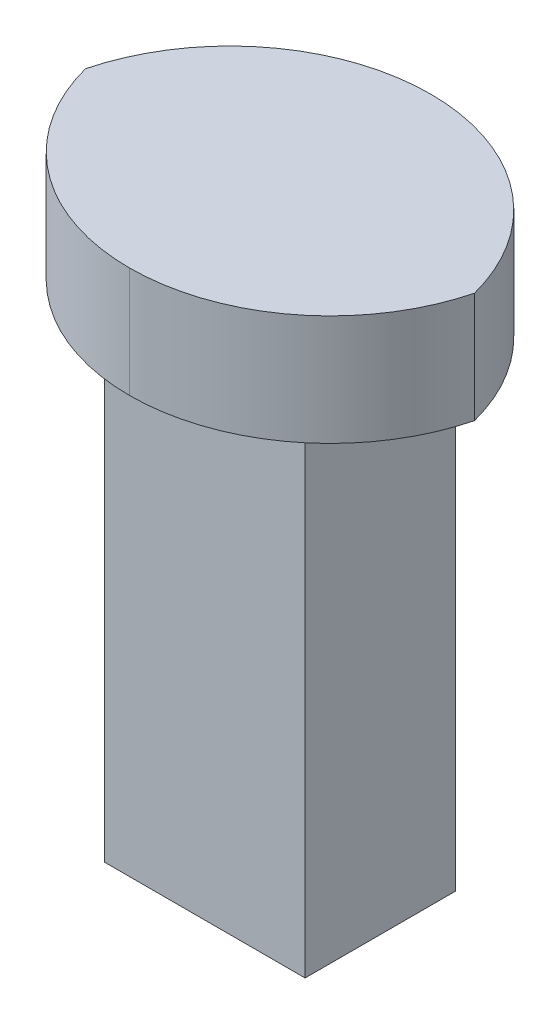
ISO-10303-21;
HEADER;
FILE_DESCRIPTION(('STEP AP214'),'2;1');
FILE_NAME('part.step','',(''),(''),'','','');
FILE_SCHEMA(('AUTOMOTIVE_DESIGN { 1 0 10303 214 1 1 1 1 }'));
ENDSEC;
DATA;
#1=APPLICATION_CONTEXT('core data for automotive mechanical design processes');
#2=APPLICATION_PROTOCOL_DEFINITION('international standard','automotive_design',2000,#1);
#3=PRODUCT_CONTEXT('',#1,'mechanical');
#4=PRODUCT('Part','Part','',(#3));
#5=PRODUCT_RELATED_PRODUCT_CATEGORY('part','',(#4));
#6=PRODUCT_DEFINITION_FORMATION('','',#4);
#7=PRODUCT_DEFINITION_CONTEXT('part definition',#1,'design');
#8=PRODUCT_DEFINITION('design','',#6,#7);
#9=PRODUCT_DEFINITION_SHAPE('','',#8);
#10=(LENGTH_UNIT() NAMED_UNIT(*) SI_UNIT(.MILLI.,.METRE.));
#11=(NAMED_UNIT(*) PLANE_ANGLE_UNIT() SI_UNIT($,.RADIAN.));
#12=(NAMED_UNIT(*) SI_UNIT($,.STERADIAN.) SOLID_ANGLE_UNIT());
#13=UNCERTAINTY_MEASURE_WITH_UNIT(LENGTH_MEASURE(1.E-05),#10,'distance_accuracy_value','');
#14=(GEOMETRIC_REPRESENTATION_CONTEXT(3) GLOBAL_UNCERTAINTY_ASSIGNED_CONTEXT((#13)) GLOBAL_UNIT_ASSIGNED_CONTEXT((#10,
#11,#12)) REPRESENTATION_CONTEXT('',''));
#15=CARTESIAN_POINT('',(0.,0.,0.));
#16=DIRECTION('',(0.,0.,1.));
#17=DIRECTION('',(1.,0.,0.));
#18=AXIS2_PLACEMENT_3D('',#15,#16,#17);
#19=CARTESIAN_POINT('',(0.,-2.794,0.));
#20=DIRECTION('',(0.,1.,0.));
#21=DIRECTION('',(0.,0.,-1.));
#22=AXIS2_PLACEMENT_3D('',#19,#20,#21);
#23=PLANE('',#22);
#24=DIRECTION('',(-1.,0.,0.));
#25=VECTOR('',#24,1.);
#26=CARTESIAN_POINT('',(0.,-2.794,1.905));
#27=LINE('',#26,#25);
#28=CARTESIAN_POINT('',(2.54,-2.794,1.905));
#29=VERTEX_POINT('',#28);
#30=CARTESIAN_POINT('',(-2.54,-2.794,1.905));
#31=VERTEX_POINT('',#30);
#32=EDGE_CURVE('E140',#29,#31,#27,.T.);
#33=ORIENTED_EDGE('',*,*,#32,.F.);
#34=DIRECTION('',(0.,0.,1.));
#35=VECTOR('',#34,1.);
#36=CARTESIAN_POINT('',(2.54,-2.794,0.));
#37=LINE('',#36,#35);
#38=CARTESIAN_POINT('',(2.54,-2.794,-1.905));
#39=VERTEX_POINT('',#38);
#40=EDGE_CURVE('E137',#39,#29,#37,.T.);
#41=ORIENTED_EDGE('',*,*,#40,.F.);
#42=DIRECTION('',(0.8,0.,-0.6));
#43=VECTOR('',#42,1.);
#44=CARTESIAN_POINT('',(0.,-2.794,0.));
#45=LINE('',#44,#43);
#46=EDGE_CURVE('E126',#31,#39,#45,.T.);
#47=ORIENTED_EDGE('',*,*,#46,.F.);
#48=EDGE_LOOP('',(#33,#41,#47));
#49=FACE_BOUND('',#48,.T.);
#50=CARTESIAN_POINT('',(0.,-2.794,1.27));
#51=DIRECTION('',(0.,-1.,0.));
#52=DIRECTION('',(0.,0.,-1.));
#53=AXIS2_PLACEMENT_3D('',#50,#51,#52);
#54=CIRCLE('',#53,5.08);
#55=CARTESIAN_POINT('',(4.91868884968342,-2.794,0.));
#56=VERTEX_POINT('',#55);
#57=CARTESIAN_POINT('',(0.,-2.794,-3.81));
#58=VERTEX_POINT('',#57);
#59=EDGE_CURVE('E160',#56,#58,#54,.F.);
#60=ORIENTED_EDGE('',*,*,#59,.F.);
#61=CARTESIAN_POINT('',(0.,-2.794,-1.27));
#62=DIRECTION('',(0.,-1.,0.));
#63=DIRECTION('',(0.,0.,-1.));
#64=AXIS2_PLACEMENT_3D('',#61,#62,#63);
#65=CIRCLE('',#64,5.08);
#66=CARTESIAN_POINT('',(0.,-2.794,3.81));
#67=VERTEX_POINT('',#66);
#68=EDGE_CURVE('E163',#67,#56,#65,.F.);
#69=ORIENTED_EDGE('',*,*,#68,.F.);
#70=CARTESIAN_POINT('',(0.,-2.794,-1.27));
#71=DIRECTION('',(0.,-1.,0.));
#72=DIRECTION('',(0.,0.,-1.));
#73=AXIS2_PLACEMENT_3D('',#70,#71,#72);
#74=CIRCLE('',#73,5.08);
#75=CARTESIAN_POINT('',(-4.91868884968342,-2.794,0.));
#76=VERTEX_POINT('',#75);
#77=EDGE_CURVE('E53',#76,#67,#74,.F.);
#78=ORIENTED_EDGE('',*,*,#77,.F.);
#79=CARTESIAN_POINT('',(0.,-2.794,1.27));
#80=DIRECTION('',(0.,-1.,0.));
#81=DIRECTION('',(0.,0.,-1.));
#82=AXIS2_PLACEMENT_3D('',#79,#80,#81);
#83=CIRCLE('',#82,5.08);
#84=EDGE_CURVE('E11',#58,#76,#83,.F.);
#85=ORIENTED_EDGE('',*,*,#84,.F.);
#86=EDGE_LOOP('',(#60,#69,#78,#85));
#87=FACE_BOUND('',#86,.T.);
#88=ADVANCED_FACE('F43',(#49,#87),#23,.F.);
#89=CARTESIAN_POINT('',(0.,0.,0.));
#90=DIRECTION('',(0.,1.,0.));
#91=DIRECTION('',(0.,0.,-1.));
#92=AXIS2_PLACEMENT_3D('',#89,#90,#91);
#93=PLANE('',#92);
#94=CARTESIAN_POINT('',(0.,0.,-1.27));
#95=DIRECTION('',(0.,-1.,0.));
#96=DIRECTION('',(0.,0.,-1.));
#97=AXIS2_PLACEMENT_3D('',#94,#95,#96);
#98=CIRCLE('',#97,5.08);
#99=CARTESIAN_POINT('',(0.,0.,3.81));
#100=VERTEX_POINT('',#99);
#101=CARTESIAN_POINT('',(-4.91868884968342,0.,0.));
#102=VERTEX_POINT('',#101);
#103=EDGE_CURVE('E153',#100,#102,#98,.T.);
#104=ORIENTED_EDGE('',*,*,#103,.F.);
#105=CARTESIAN_POINT('',(0.,0.,-1.27));
#106=DIRECTION('',(0.,-1.,0.));
#107=DIRECTION('',(0.,0.,-1.));
#108=AXIS2_PLACEMENT_3D('',#105,#106,#107);
#109=CIRCLE('',#108,5.08);
#110=CARTESIAN_POINT('',(4.91868884968342,0.,0.));
#111=VERTEX_POINT('',#110);
#112=EDGE_CURVE('E149',#111,#100,#109,.T.);
#113=ORIENTED_EDGE('',*,*,#112,.F.);
#114=CARTESIAN_POINT('',(0.,0.,1.27));
#115=DIRECTION('',(0.,-1.,0.));
#116=DIRECTION('',(0.,0.,-1.));
#117=AXIS2_PLACEMENT_3D('',#114,#115,#116);
#118=CIRCLE('',#117,5.08);
#119=CARTESIAN_POINT('',(0.,0.,-3.81));
#120=VERTEX_POINT('',#119);
#121=EDGE_CURVE('E146',#120,#111,#118,.T.);
#122=ORIENTED_EDGE('',*,*,#121,.F.);
#123=CARTESIAN_POINT('',(0.,0.,1.27));
#124=DIRECTION('',(0.,-1.,0.));
#125=DIRECTION('',(0.,0.,-1.));
#126=AXIS2_PLACEMENT_3D('',#123,#124,#125);
#127=CIRCLE('',#126,5.08);
#128=EDGE_CURVE('E156',#102,#120,#127,.T.);
#129=ORIENTED_EDGE('',*,*,#128,.F.);
#130=EDGE_LOOP('',(#104,#113,#122,#129));
#131=FACE_BOUND('',#130,.T.);
#132=ADVANCED_FACE('F184',(#131),#93,.T.);
#133=CARTESIAN_POINT('',(2.54,-15.24,-1.905));
#134=DIRECTION('',(-0.6,0.,-0.8));
#135=DIRECTION('',(0.8,0.,-0.6));
#136=AXIS2_PLACEMENT_3D('',#133,#134,#135);
#137=PLANE('',#136);
#138=ORIENTED_EDGE('',*,*,#46,.T.);
#139=DIRECTION('',(0.,1.,0.));
#140=VECTOR('',#139,1.);
#141=CARTESIAN_POINT('',(2.54,-15.24,-1.905));
#142=LINE('',#141,#140);
#143=CARTESIAN_POINT('',(2.54,-15.24,-1.905));
#144=VERTEX_POINT('',#143);
#145=EDGE_CURVE('E109',#144,#39,#142,.T.);
#146=ORIENTED_EDGE('',*,*,#145,.F.);
#147=DIRECTION('',(0.8,0.,-0.6));
#148=VECTOR('',#147,1.);
#149=CARTESIAN_POINT('',(2.54,-15.24,-1.905));
#150=LINE('',#149,#148);
#151=CARTESIAN_POINT('',(-2.54,-15.24,1.905));
#152=VERTEX_POINT('',#151);
#153=EDGE_CURVE('E116',#152,#144,#150,.T.);
#154=ORIENTED_EDGE('',*,*,#153,.F.);
#155=DIRECTION('',(0.,1.,0.));
#156=VECTOR('',#155,1.);
#157=CARTESIAN_POINT('',(-2.54,-15.24,1.905));
#158=LINE('',#157,#156);
#159=EDGE_CURVE('E132',#152,#31,#158,.T.);
#160=ORIENTED_EDGE('',*,*,#159,.T.);
#161=EDGE_LOOP('',(#138,#146,#154,#160));
#162=FACE_BOUND('',#161,.T.);
#163=ADVANCED_FACE('F124',(#162),#137,.T.);
#164=CARTESIAN_POINT('',(-2.54,-15.24,1.905));
#165=DIRECTION('',(0.,0.,1.));
#166=DIRECTION('',(-1.,0.,0.));
#167=AXIS2_PLACEMENT_3D('',#164,#165,#166);
#168=PLANE('',#167);
#169=ORIENTED_EDGE('',*,*,#32,.T.);
#170=ORIENTED_EDGE('',*,*,#159,.F.);
#171=DIRECTION('',(-1.,0.,0.));
#172=VECTOR('',#171,1.);
#173=CARTESIAN_POINT('',(-2.54,-15.24,1.905));
#174=LINE('',#173,#172);
#175=CARTESIAN_POINT('',(2.54,-15.24,1.905));
#176=VERTEX_POINT('',#175);
#177=EDGE_CURVE('E115',#176,#152,#174,.T.);
#178=ORIENTED_EDGE('',*,*,#177,.F.);
#179=DIRECTION('',(0.,1.,0.));
#180=VECTOR('',#179,1.);
#181=CARTESIAN_POINT('',(2.54,-15.24,1.905));
#182=LINE('',#181,#180);
#183=EDGE_CURVE('E111',#176,#29,#182,.T.);
#184=ORIENTED_EDGE('',*,*,#183,.T.);
#185=EDGE_LOOP('',(#169,#170,#178,#184));
#186=FACE_BOUND('',#185,.T.);
#187=ADVANCED_FACE('F208',(#186),#168,.T.);
#188=CARTESIAN_POINT('',(2.54,-15.24,1.905));
#189=DIRECTION('',(1.,0.,0.));
#190=DIRECTION('',(0.,0.,1.));
#191=AXIS2_PLACEMENT_3D('',#188,#189,#190);
#192=PLANE('',#191);
#193=ORIENTED_EDGE('',*,*,#40,.T.);
#194=ORIENTED_EDGE('',*,*,#183,.F.);
#195=DIRECTION('',(0.,0.,1.));
#196=VECTOR('',#195,1.);
#197=CARTESIAN_POINT('',(2.54,-15.24,1.905));
#198=LINE('',#197,#196);
#199=EDGE_CURVE('E104',#144,#176,#198,.T.);
#200=ORIENTED_EDGE('',*,*,#199,.F.);
#201=ORIENTED_EDGE('',*,*,#145,.T.);
#202=EDGE_LOOP('',(#193,#194,#200,#201));
#203=FACE_BOUND('',#202,.T.);
#204=ADVANCED_FACE('F107',(#203),#192,.T.);
#205=CARTESIAN_POINT('',(0.,-15.24,0.));
#206=DIRECTION('',(0.,1.,0.));
#207=DIRECTION('',(0.,0.,-1.));
#208=AXIS2_PLACEMENT_3D('',#205,#206,#207);
#209=PLANE('',#208);
#210=ORIENTED_EDGE('',*,*,#153,.T.);
#211=ORIENTED_EDGE('',*,*,#199,.T.);
#212=ORIENTED_EDGE('',*,*,#177,.T.);
#213=EDGE_LOOP('',(#210,#211,#212));
#214=FACE_BOUND('',#213,.T.);
#215=ADVANCED_FACE('F119',(#214),#209,.F.);
#216=CARTESIAN_POINT('',(0.,-2.794,-1.27));
#217=DIRECTION('',(0.,1.,0.));
#218=DIRECTION('',(0.,0.,-1.));
#219=AXIS2_PLACEMENT_3D('',#216,#217,#218);
#220=CYLINDRICAL_SURFACE('',#219,5.08);
#221=DIRECTION('',(0.,1.,0.));
#222=VECTOR('',#221,1.);
#223=CARTESIAN_POINT('',(0.,-2.794,3.81));
#224=LINE('',#223,#222);
#225=EDGE_CURVE('E172',#100,#67,#224,.F.);
#226=ORIENTED_EDGE('',*,*,#225,.T.);
#227=ORIENTED_EDGE('',*,*,#68,.T.);
#228=DIRECTION('',(0.,-1.,0.));
#229=VECTOR('',#228,1.);
#230=CARTESIAN_POINT('',(4.91868884968342,-1.397,0.));
#231=LINE('',#230,#229);
#232=EDGE_CURVE('E47',#56,#111,#231,.F.);
#233=ORIENTED_EDGE('',*,*,#232,.T.);
#234=ORIENTED_EDGE('',*,*,#112,.T.);
#235=EDGE_LOOP('',(#226,#227,#233,#234));
#236=FACE_BOUND('',#235,.T.);
#237=ADVANCED_FACE('F45',(#236),#220,.T.);
#238=CARTESIAN_POINT('',(0.,-2.794,1.27));
#239=DIRECTION('',(0.,-1.,0.));
#240=DIRECTION('',(0.,0.,1.));
#241=AXIS2_PLACEMENT_3D('',#238,#239,#240);
#242=CYLINDRICAL_SURFACE('',#241,5.08);
#243=ORIENTED_EDGE('',*,*,#232,.F.);
#244=ORIENTED_EDGE('',*,*,#59,.T.);
#245=DIRECTION('',(0.,1.,0.));
#246=VECTOR('',#245,1.);
#247=CARTESIAN_POINT('',(0.,0.,-3.81));
#248=LINE('',#247,#246);
#249=EDGE_CURVE('E170',#58,#120,#248,.T.);
#250=ORIENTED_EDGE('',*,*,#249,.T.);
#251=ORIENTED_EDGE('',*,*,#121,.T.);
#252=EDGE_LOOP('',(#243,#244,#250,#251));
#253=FACE_BOUND('',#252,.T.);
#254=ADVANCED_FACE('F181',(#253),#242,.T.);
#255=CARTESIAN_POINT('',(0.,-2.794,-1.27));
#256=DIRECTION('',(0.,-1.,0.));
#257=DIRECTION('',(0.,0.,1.));
#258=AXIS2_PLACEMENT_3D('',#255,#256,#257);
#259=CYLINDRICAL_SURFACE('',#258,5.08);
#260=ORIENTED_EDGE('',*,*,#225,.F.);
#261=ORIENTED_EDGE('',*,*,#103,.T.);
#262=DIRECTION('',(0.,-1.,0.));
#263=VECTOR('',#262,1.);
#264=CARTESIAN_POINT('',(-4.91868884968342,-1.397,0.));
#265=LINE('',#264,#263);
#266=EDGE_CURVE('E61',#102,#76,#265,.T.);
#267=ORIENTED_EDGE('',*,*,#266,.T.);
#268=ORIENTED_EDGE('',*,*,#77,.T.);
#269=EDGE_LOOP('',(#260,#261,#267,#268));
#270=FACE_BOUND('',#269,.T.);
#271=ADVANCED_FACE('F185',(#270),#259,.T.);
#272=CARTESIAN_POINT('',(0.,-2.794,1.27));
#273=DIRECTION('',(0.,1.,0.));
#274=DIRECTION('',(0.,0.,-1.));
#275=AXIS2_PLACEMENT_3D('',#272,#273,#274);
#276=CYLINDRICAL_SURFACE('',#275,5.08);
#277=ORIENTED_EDGE('',*,*,#84,.T.);
#278=ORIENTED_EDGE('',*,*,#266,.F.);
#279=ORIENTED_EDGE('',*,*,#128,.T.);
#280=ORIENTED_EDGE('',*,*,#249,.F.);
#281=EDGE_LOOP('',(#277,#278,#279,#280));
#282=FACE_BOUND('',#281,.T.);
#283=ADVANCED_FACE('F190',(#282),#276,.T.);
#284=CLOSED_SHELL('',(#88,#132,#163,#187,#204,#215,#237,#254,#271,#283));
#285=MANIFOLD_SOLID_BREP('B2',#284);
#286=ADVANCED_BREP_SHAPE_REPRESENTATION('',(#18,#285),#14);
#287=SHAPE_DEFINITION_REPRESENTATION(#9,#286);
ENDSEC;
END-ISO-10303-21;
